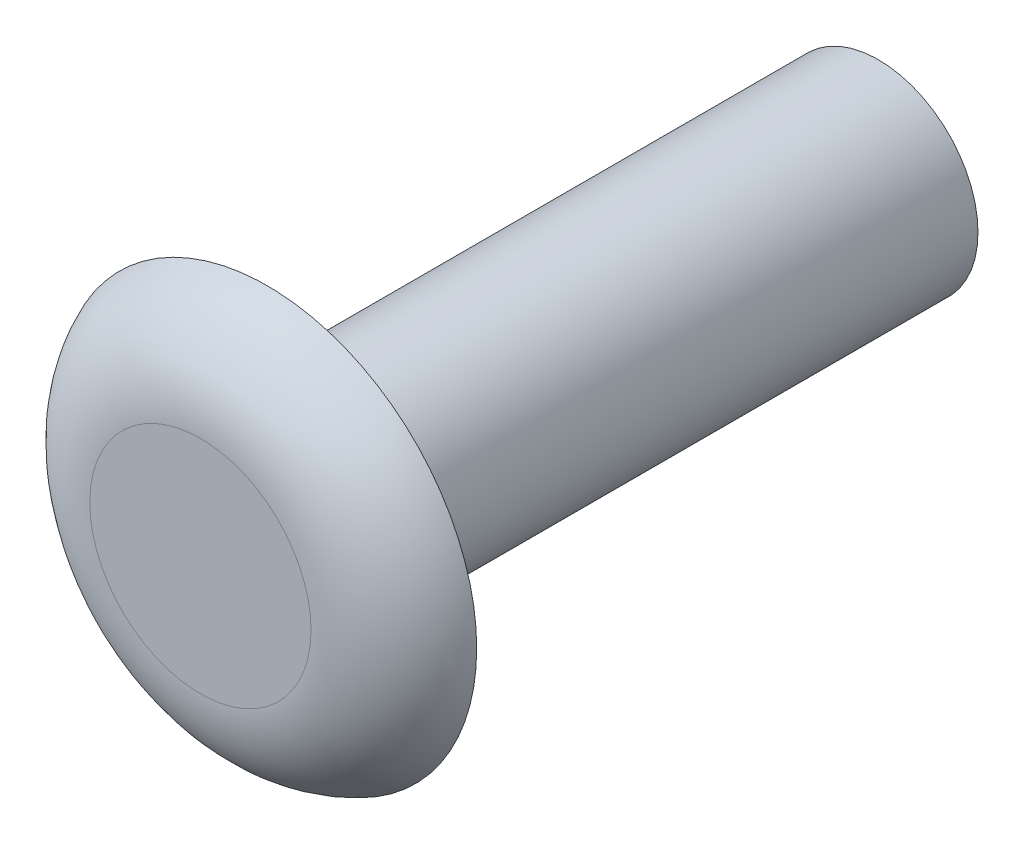
ISO-10303-21;
HEADER;
FILE_DESCRIPTION(('STEP AP214'),'2;1');
FILE_NAME('part.step','',(''),(''),'','','');
FILE_SCHEMA(('AUTOMOTIVE_DESIGN { 1 0 10303 214 1 1 1 1 }'));
ENDSEC;
DATA;
#1=APPLICATION_CONTEXT('core data for automotive mechanical design processes');
#2=APPLICATION_PROTOCOL_DEFINITION('international standard','automotive_design',2000,#1);
#3=PRODUCT_CONTEXT('',#1,'mechanical');
#4=PRODUCT('Part','Part','',(#3));
#5=PRODUCT_RELATED_PRODUCT_CATEGORY('part','',(#4));
#6=PRODUCT_DEFINITION_FORMATION('','',#4);
#7=PRODUCT_DEFINITION_CONTEXT('part definition',#1,'design');
#8=PRODUCT_DEFINITION('design','',#6,#7);
#9=PRODUCT_DEFINITION_SHAPE('','',#8);
#10=(LENGTH_UNIT() NAMED_UNIT(*) SI_UNIT(.MILLI.,.METRE.));
#11=(NAMED_UNIT(*) PLANE_ANGLE_UNIT() SI_UNIT($,.RADIAN.));
#12=(NAMED_UNIT(*) SI_UNIT($,.STERADIAN.) SOLID_ANGLE_UNIT());
#13=UNCERTAINTY_MEASURE_WITH_UNIT(LENGTH_MEASURE(1.E-05),#10,'distance_accuracy_value','');
#14=(GEOMETRIC_REPRESENTATION_CONTEXT(3) GLOBAL_UNCERTAINTY_ASSIGNED_CONTEXT((#13)) GLOBAL_UNIT_ASSIGNED_CONTEXT((#10,
#11,#12)) REPRESENTATION_CONTEXT('',''));
#15=CARTESIAN_POINT('',(0.,0.,0.));
#16=DIRECTION('',(0.,0.,1.));
#17=DIRECTION('',(1.,0.,0.));
#18=AXIS2_PLACEMENT_3D('',#15,#16,#17);
#19=CARTESIAN_POINT('',(0.,0.,1.6002));
#20=DIRECTION('',(0.,0.,1.));
#21=DIRECTION('',(1.,0.,0.));
#22=AXIS2_PLACEMENT_3D('',#19,#20,#21);
#23=PLANE('',#22);
#24=CARTESIAN_POINT('',(0.,0.,1.6002));
#25=DIRECTION('',(0.,0.,1.));
#26=DIRECTION('',(1.,0.,0.));
#27=AXIS2_PLACEMENT_3D('',#24,#25,#26);
#28=CIRCLE('',#27,2.64405934475841);
#29=CARTESIAN_POINT('',(2.64405934475841,0.,1.6002));
#30=VERTEX_POINT('',#29);
#31=EDGE_CURVE('E10',#30,#30,#28,.T.);
#32=ORIENTED_EDGE('',*,*,#31,.T.);
#33=EDGE_LOOP('',(#32));
#34=FACE_BOUND('',#33,.T.);
#35=ADVANCED_FACE('F37',(#34),#23,.T.);
#36=CARTESIAN_POINT('',(0.,0.,0.));
#37=DIRECTION('',(0.,0.,1.));
#38=DIRECTION('',(1.,0.,0.));
#39=AXIS2_PLACEMENT_3D('',#36,#37,#38);
#40=PLANE('',#39);
#41=CARTESIAN_POINT('',(0.,0.,0.));
#42=DIRECTION('',(0.,0.,1.));
#43=DIRECTION('',(1.,0.,0.));
#44=AXIS2_PLACEMENT_3D('',#41,#42,#43);
#45=CIRCLE('',#44,2.38125);
#46=CARTESIAN_POINT('',(2.38125,0.,0.));
#47=VERTEX_POINT('',#46);
#48=EDGE_CURVE('E52',#47,#47,#45,.T.);
#49=ORIENTED_EDGE('',*,*,#48,.T.);
#50=EDGE_LOOP('',(#49));
#51=FACE_BOUND('',#50,.T.);
#52=CARTESIAN_POINT('',(0.,0.,0.));
#53=DIRECTION('',(0.,0.,1.));
#54=DIRECTION('',(1.,0.,0.));
#55=AXIS2_PLACEMENT_3D('',#52,#53,#54);
#56=CIRCLE('',#55,5.0038);
#57=CARTESIAN_POINT('',(5.0038,0.,0.));
#58=VERTEX_POINT('',#57);
#59=EDGE_CURVE('E44',#58,#58,#56,.T.);
#60=ORIENTED_EDGE('',*,*,#59,.F.);
#61=EDGE_LOOP('',(#60));
#62=FACE_BOUND('',#61,.T.);
#63=ADVANCED_FACE('F58',(#51,#62),#40,.F.);
#64=CARTESIAN_POINT('',(0.,0.,-14.605));
#65=DIRECTION('',(0.,0.,1.));
#66=DIRECTION('',(1.,0.,0.));
#67=AXIS2_PLACEMENT_3D('',#64,#65,#66);
#68=CYLINDRICAL_SURFACE('',#67,2.38125);
#69=CARTESIAN_POINT('',(0.,0.,-14.605));
#70=DIRECTION('',(0.,0.,1.));
#71=DIRECTION('',(1.,0.,0.));
#72=AXIS2_PLACEMENT_3D('',#69,#70,#71);
#73=CIRCLE('',#72,2.38125);
#74=CARTESIAN_POINT('',(2.38125,0.,-14.605));
#75=VERTEX_POINT('',#74);
#76=EDGE_CURVE('E48',#75,#75,#73,.T.);
#77=CARTESIAN_POINT('',(2.38125,0.,-14.605));
#78=CARTESIAN_POINT('',(2.38125,0.,-14.4528645833333));
#79=CARTESIAN_POINT('',(2.38125,0.,-14.3007291666667));
#80=CARTESIAN_POINT('',(2.38125,0.,-13.9964583333333));
#81=CARTESIAN_POINT('',(2.38125,0.,-13.8443229166667));
#82=CARTESIAN_POINT('',(2.38125,0.,-13.5400520833333));
#83=CARTESIAN_POINT('',(2.38125,0.,-13.3879166666667));
#84=CARTESIAN_POINT('',(2.38125,0.,-13.0836458333333));
#85=CARTESIAN_POINT('',(2.38125,0.,-12.9315104166667));
#86=CARTESIAN_POINT('',(2.38125,0.,-12.6272395833333));
#87=CARTESIAN_POINT('',(2.38125,0.,-12.4751041666667));
#88=CARTESIAN_POINT('',(2.38125,0.,-12.1708333333333));
#89=CARTESIAN_POINT('',(2.38125,0.,-12.0186979166667));
#90=CARTESIAN_POINT('',(2.38125,0.,-11.7144270833333));
#91=CARTESIAN_POINT('',(2.38125,0.,-11.5622916666667));
#92=CARTESIAN_POINT('',(2.38125,0.,-11.2580208333333));
#93=CARTESIAN_POINT('',(2.38125,0.,-11.1058854166667));
#94=CARTESIAN_POINT('',(2.38125,0.,-10.8016145833333));
#95=CARTESIAN_POINT('',(2.38125,0.,-10.6494791666667));
#96=CARTESIAN_POINT('',(2.38125,0.,-10.3452083333333));
#97=CARTESIAN_POINT('',(2.38125,0.,-10.1930729166667));
#98=CARTESIAN_POINT('',(2.38125,0.,-9.88880208333333));
#99=CARTESIAN_POINT('',(2.38125,0.,-9.73666666666667));
#100=CARTESIAN_POINT('',(2.38125,0.,-9.43239583333333));
#101=CARTESIAN_POINT('',(2.38125,0.,-9.28026041666667));
#102=CARTESIAN_POINT('',(2.38125,0.,-8.97598958333333));
#103=CARTESIAN_POINT('',(2.38125,0.,-8.82385416666667));
#104=CARTESIAN_POINT('',(2.38125,0.,-8.51958333333333));
#105=CARTESIAN_POINT('',(2.38125,0.,-8.36744791666667));
#106=CARTESIAN_POINT('',(2.38125,0.,-8.06317708333333));
#107=CARTESIAN_POINT('',(2.38125,0.,-7.91104166666667));
#108=CARTESIAN_POINT('',(2.38125,0.,-7.60677083333333));
#109=CARTESIAN_POINT('',(2.38125,0.,-7.45463541666667));
#110=CARTESIAN_POINT('',(2.38125,0.,-7.15036458333333));
#111=CARTESIAN_POINT('',(2.38125,0.,-6.99822916666667));
#112=CARTESIAN_POINT('',(2.38125,0.,-6.69395833333333));
#113=CARTESIAN_POINT('',(2.38125,0.,-6.54182291666667));
#114=CARTESIAN_POINT('',(2.38125,0.,-6.23755208333333));
#115=CARTESIAN_POINT('',(2.38125,0.,-6.08541666666667));
#116=CARTESIAN_POINT('',(2.38125,0.,-5.78114583333333));
#117=CARTESIAN_POINT('',(2.38125,0.,-5.62901041666667));
#118=CARTESIAN_POINT('',(2.38125,0.,-5.32473958333333));
#119=CARTESIAN_POINT('',(2.38125,0.,-5.17260416666667));
#120=CARTESIAN_POINT('',(2.38125,0.,-4.86833333333333));
#121=CARTESIAN_POINT('',(2.38125,0.,-4.71619791666667));
#122=CARTESIAN_POINT('',(2.38125,0.,-4.41192708333333));
#123=CARTESIAN_POINT('',(2.38125,0.,-4.25979166666667));
#124=CARTESIAN_POINT('',(2.38125,0.,-3.95552083333333));
#125=CARTESIAN_POINT('',(2.38125,0.,-3.80338541666667));
#126=CARTESIAN_POINT('',(2.38125,0.,-3.49911458333333));
#127=CARTESIAN_POINT('',(2.38125,0.,-3.34697916666667));
#128=CARTESIAN_POINT('',(2.38125,0.,-3.04270833333333));
#129=CARTESIAN_POINT('',(2.38125,0.,-2.89057291666667));
#130=CARTESIAN_POINT('',(2.38125,0.,-2.58630208333333));
#131=CARTESIAN_POINT('',(2.38125,0.,-2.43416666666667));
#132=CARTESIAN_POINT('',(2.38125,0.,-2.12989583333333));
#133=CARTESIAN_POINT('',(2.38125,0.,-1.97776041666667));
#134=CARTESIAN_POINT('',(2.38125,0.,-1.67348958333333));
#135=CARTESIAN_POINT('',(2.38125,0.,-1.52135416666667));
#136=CARTESIAN_POINT('',(2.38125,0.,-1.21708333333333));
#137=CARTESIAN_POINT('',(2.38125,0.,-1.06494791666667));
#138=CARTESIAN_POINT('',(2.38125,0.,-0.760677083333333));
#139=CARTESIAN_POINT('',(2.38125,0.,-0.608541666666666));
#140=CARTESIAN_POINT('',(2.38125,0.,-0.304270833333333));
#141=CARTESIAN_POINT('',(2.38125,0.,-0.152135416666666));
#142=CARTESIAN_POINT('',(2.38125,0.,0.));
#143=B_SPLINE_CURVE_WITH_KNOTS('',3,(#77,#78,#79,#80,#81,#82,#83,#84,#85,#86,#87,#88,#89,#90,
#91,#92,#93,#94,#95,#96,#97,#98,#99,#100,#101,#102,#103,#104,#105,#106,#107,#108,#109,#110,#111,
#112,#113,#114,#115,#116,#117,#118,#119,#120,#121,#122,#123,#124,#125,#126,#127,#128,#129,#130,
#131,#132,#133,#134,#135,#136,#137,#138,#139,#140,#141,#142),.UNSPECIFIED.,.F.,.F.,(4,2,2,2,2,2,
2,2,2,2,2,2,2,2,2,2,2,2,2,2,2,2,2,2,2,2,2,2,2,2,2,2,4),(0.,0.456406249999999,0.912812499999999,
1.36921875,1.825625,2.28203125,2.7384375,3.19484375,3.65125,4.10765625,4.5640625,5.02046875,
5.476875,5.93328125,6.3896875,6.84609375,7.3025,7.75890625,8.2153125,8.67171875,9.128125,
9.58453125,10.0409375,10.49734375,10.95375,11.41015625,11.8665625,12.32296875,12.779375,
13.23578125,13.6921875,14.14859375,14.605),.UNSPECIFIED.);
#144=EDGE_CURVE('BSEAM61',#75,#47,#143,.T.);
#145=ORIENTED_EDGE('',*,*,#76,.T.);
#146=ORIENTED_EDGE('',*,*,#48,.F.);
#147=ORIENTED_EDGE('',*,*,#144,.T.);
#148=ORIENTED_EDGE('',*,*,#144,.F.);
#149=EDGE_LOOP('',(#145,#147,#146,#148));
#150=FACE_BOUND('',#149,.T.);
#151=ADVANCED_FACE('F61',(#150),#68,.T.);
#152=CARTESIAN_POINT('',(0.,0.,-14.605));
#153=DIRECTION('',(0.,0.,1.));
#154=DIRECTION('',(1.,0.,0.));
#155=AXIS2_PLACEMENT_3D('',#152,#153,#154);
#156=PLANE('',#155);
#157=ORIENTED_EDGE('',*,*,#76,.F.);
#158=EDGE_LOOP('',(#157));
#159=FACE_BOUND('',#158,.T.);
#160=ADVANCED_FACE('F63',(#159),#156,.F.);
#161=CARTESIAN_POINT('',(0.,0.,-0.9398));
#162=DIRECTION('',(0.,0.,-1.));
#163=DIRECTION('',(-1.,0.,0.));
#164=AXIS2_PLACEMENT_3D('',#161,#162,#163);
#165=TOROIDAL_SURFACE('',#164,2.64405934475841,2.54);
#166=ORIENTED_EDGE('',*,*,#59,.T.);
#167=EDGE_LOOP('',(#166));
#168=FACE_BOUND('',#167,.T.);
#169=ORIENTED_EDGE('',*,*,#31,.F.);
#170=EDGE_LOOP('',(#169));
#171=FACE_BOUND('',#170,.T.);
#172=ADVANCED_FACE('F39',(#168,#171),#165,.T.);
#173=CLOSED_SHELL('',(#35,#63,#151,#160,#172));
#174=MANIFOLD_SOLID_BREP('B2',#173);
#175=ADVANCED_BREP_SHAPE_REPRESENTATION('',(#18,#174),#14);
#176=SHAPE_DEFINITION_REPRESENTATION(#9,#175);
ENDSEC;
END-ISO-10303-21;
